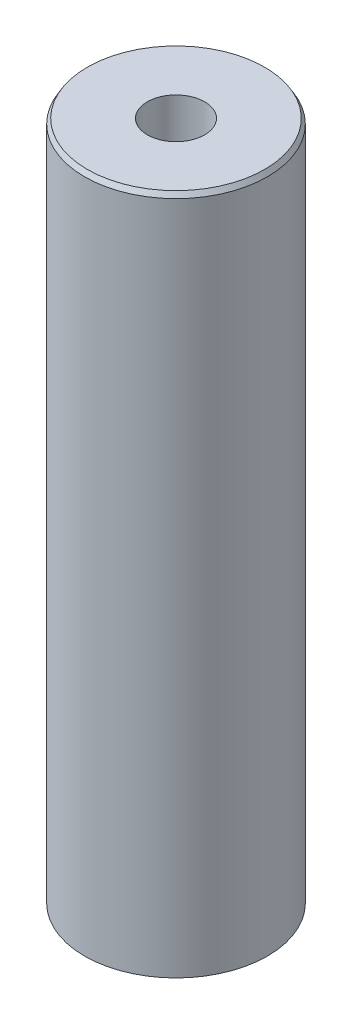
ISO-10303-21;
HEADER;
FILE_DESCRIPTION(('STEP AP214'),'2;1');
FILE_NAME('part.step','',(''),(''),'','','');
FILE_SCHEMA(('AUTOMOTIVE_DESIGN { 1 0 10303 214 1 1 1 1 }'));
ENDSEC;
DATA;
#1=APPLICATION_CONTEXT('core data for automotive mechanical design processes');
#2=APPLICATION_PROTOCOL_DEFINITION('international standard','automotive_design',2000,#1);
#3=PRODUCT_CONTEXT('',#1,'mechanical');
#4=PRODUCT('Part','Part','',(#3));
#5=PRODUCT_RELATED_PRODUCT_CATEGORY('part','',(#4));
#6=PRODUCT_DEFINITION_FORMATION('','',#4);
#7=PRODUCT_DEFINITION_CONTEXT('part definition',#1,'design');
#8=PRODUCT_DEFINITION('design','',#6,#7);
#9=PRODUCT_DEFINITION_SHAPE('','',#8);
#10=(LENGTH_UNIT() NAMED_UNIT(*) SI_UNIT(.MILLI.,.METRE.));
#11=(NAMED_UNIT(*) PLANE_ANGLE_UNIT() SI_UNIT($,.RADIAN.));
#12=(NAMED_UNIT(*) SI_UNIT($,.STERADIAN.) SOLID_ANGLE_UNIT());
#13=UNCERTAINTY_MEASURE_WITH_UNIT(LENGTH_MEASURE(1.E-05),#10,'distance_accuracy_value','');
#14=(GEOMETRIC_REPRESENTATION_CONTEXT(3) GLOBAL_UNCERTAINTY_ASSIGNED_CONTEXT((#13)) GLOBAL_UNIT_ASSIGNED_CONTEXT((#10,
#11,#12)) REPRESENTATION_CONTEXT('',''));
#15=CARTESIAN_POINT('',(0.,0.,0.));
#16=DIRECTION('',(0.,0.,1.));
#17=DIRECTION('',(1.,0.,0.));
#18=AXIS2_PLACEMENT_3D('',#15,#16,#17);
#19=CARTESIAN_POINT('',(0.,111.945952677701,0.));
#20=DIRECTION('',(0.,-1.,0.));
#21=DIRECTION('',(0.,0.,-1.));
#22=AXIS2_PLACEMENT_3D('',#19,#20,#21);
#23=CYLINDRICAL_SURFACE('',#22,15.);
#24=CARTESIAN_POINT('',(0.,111.139646793176,0.));
#25=DIRECTION('',(0.,1.,0.));
#26=DIRECTION('',(0.,0.,1.));
#27=AXIS2_PLACEMENT_3D('',#24,#25,#26);
#28=CIRCLE('',#27,15.);
#29=CARTESIAN_POINT('',(0.,111.139646793176,15.));
#30=VERTEX_POINT('',#29);
#31=EDGE_CURVE('E50',#30,#30,#28,.F.);
#32=ORIENTED_EDGE('',*,*,#31,.T.);
#33=EDGE_LOOP('',(#32));
#34=FACE_BOUND('',#33,.T.);
#35=CARTESIAN_POINT('',(0.,0.465520919479739,0.));
#36=DIRECTION('',(0.,1.,0.));
#37=DIRECTION('',(0.,0.,1.));
#38=AXIS2_PLACEMENT_3D('',#35,#36,#37);
#39=CIRCLE('',#38,15.);
#40=CARTESIAN_POINT('',(0.,0.465520919479739,15.));
#41=VERTEX_POINT('',#40);
#42=EDGE_CURVE('E51',#41,#41,#39,.T.);
#43=ORIENTED_EDGE('',*,*,#42,.T.);
#44=EDGE_LOOP('',(#43));
#45=FACE_BOUND('',#44,.T.);
#46=ADVANCED_FACE('F39',(#34,#45),#23,.T.);
#47=CARTESIAN_POINT('',(0.,111.945952677701,0.));
#48=DIRECTION('',(0.,1.,0.));
#49=DIRECTION('',(0.,0.,1.));
#50=AXIS2_PLACEMENT_3D('',#47,#48,#49);
#51=PLANE('',#50);
#52=CARTESIAN_POINT('',(0.,111.945952677701,0.));
#53=DIRECTION('',(0.,1.,0.));
#54=DIRECTION('',(0.,0.,1.));
#55=AXIS2_PLACEMENT_3D('',#52,#53,#54);
#56=CIRCLE('',#55,14.5344790805202);
#57=CARTESIAN_POINT('',(0.,111.945952677701,14.5344790805202));
#58=VERTEX_POINT('',#57);
#59=EDGE_CURVE('E54',#58,#58,#56,.T.);
#60=ORIENTED_EDGE('',*,*,#59,.T.);
#61=EDGE_LOOP('',(#60));
#62=FACE_BOUND('',#61,.T.);
#63=CARTESIAN_POINT('',(0.,111.945952677701,0.));
#64=DIRECTION('',(0.,1.,0.));
#65=DIRECTION('',(0.,0.,1.));
#66=AXIS2_PLACEMENT_3D('',#63,#64,#65);
#67=CIRCLE('',#66,4.70321500673244);
#68=CARTESIAN_POINT('',(0.,111.945952677701,4.70321500673244));
#69=VERTEX_POINT('',#68);
#70=EDGE_CURVE('E58',#69,#69,#67,.T.);
#71=ORIENTED_EDGE('',*,*,#70,.F.);
#72=EDGE_LOOP('',(#71));
#73=FACE_BOUND('',#72,.T.);
#74=ADVANCED_FACE('F69',(#62,#73),#51,.T.);
#75=CARTESIAN_POINT('',(0.,0.,0.));
#76=DIRECTION('',(0.,1.,0.));
#77=DIRECTION('',(0.,0.,1.));
#78=AXIS2_PLACEMENT_3D('',#75,#76,#77);
#79=PLANE('',#78);
#80=CARTESIAN_POINT('',(0.,0.,0.));
#81=DIRECTION('',(0.,1.,0.));
#82=DIRECTION('',(0.,0.,1.));
#83=AXIS2_PLACEMENT_3D('',#80,#81,#82);
#84=CIRCLE('',#83,14.1936941154749);
#85=CARTESIAN_POINT('',(0.,0.,14.1936941154749));
#86=VERTEX_POINT('',#85);
#87=EDGE_CURVE('E10',#86,#86,#84,.F.);
#88=ORIENTED_EDGE('',*,*,#87,.T.);
#89=EDGE_LOOP('',(#88));
#90=FACE_BOUND('',#89,.T.);
#91=CARTESIAN_POINT('',(0.,0.,0.));
#92=DIRECTION('',(0.,1.,0.));
#93=DIRECTION('',(0.,0.,1.));
#94=AXIS2_PLACEMENT_3D('',#91,#92,#93);
#95=CIRCLE('',#94,4.70321500673244);
#96=CARTESIAN_POINT('',(0.,0.,4.70321500673244));
#97=VERTEX_POINT('',#96);
#98=EDGE_CURVE('E63',#97,#97,#95,.T.);
#99=ORIENTED_EDGE('',*,*,#98,.T.);
#100=EDGE_LOOP('',(#99));
#101=FACE_BOUND('',#100,.T.);
#102=ADVANCED_FACE('F75',(#90,#101),#79,.F.);
#103=CARTESIAN_POINT('',(0.,111.945952677701,0.));
#104=DIRECTION('',(0.,-1.,0.));
#105=DIRECTION('',(0.,0.,-1.));
#106=AXIS2_PLACEMENT_3D('',#103,#104,#105);
#107=CYLINDRICAL_SURFACE('',#106,4.70321500673244);
#108=ORIENTED_EDGE('',*,*,#70,.T.);
#109=EDGE_LOOP('',(#108));
#110=FACE_BOUND('',#109,.T.);
#111=ORIENTED_EDGE('',*,*,#98,.F.);
#112=EDGE_LOOP('',(#111));
#113=FACE_BOUND('',#112,.T.);
#114=ADVANCED_FACE('F70',(#110,#113),#107,.F.);
#115=CARTESIAN_POINT('',(0.,111.945952677701,0.));
#116=DIRECTION('',(0.,-1.,0.));
#117=DIRECTION('',(0.,0.,-1.));
#118=AXIS2_PLACEMENT_3D('',#115,#116,#117);
#119=CONICAL_SURFACE('',#118,14.5344790805202,0.523598775598282);
#120=ORIENTED_EDGE('',*,*,#31,.F.);
#121=EDGE_LOOP('',(#120));
#122=FACE_BOUND('',#121,.T.);
#123=ORIENTED_EDGE('',*,*,#59,.F.);
#124=EDGE_LOOP('',(#123));
#125=FACE_BOUND('',#124,.T.);
#126=ADVANCED_FACE('F81',(#122,#125),#119,.T.);
#127=CARTESIAN_POINT('',(0.,0.465520919479739,0.));
#128=DIRECTION('',(0.,1.,0.));
#129=DIRECTION('',(0.,0.,1.));
#130=AXIS2_PLACEMENT_3D('',#127,#128,#129);
#131=CONICAL_SURFACE('',#130,15.,1.04719755119659);
#132=ORIENTED_EDGE('',*,*,#87,.F.);
#133=EDGE_LOOP('',(#132));
#134=FACE_BOUND('',#133,.T.);
#135=ORIENTED_EDGE('',*,*,#42,.F.);
#136=EDGE_LOOP('',(#135));
#137=FACE_BOUND('',#136,.T.);
#138=ADVANCED_FACE('F45',(#134,#137),#131,.T.);
#139=CLOSED_SHELL('',(#46,#74,#102,#114,#126,#138));
#140=MANIFOLD_SOLID_BREP('B2',#139);
#141=ADVANCED_BREP_SHAPE_REPRESENTATION('',(#18,#140),#14);
#142=SHAPE_DEFINITION_REPRESENTATION(#9,#141);
ENDSEC;
END-ISO-10303-21;
